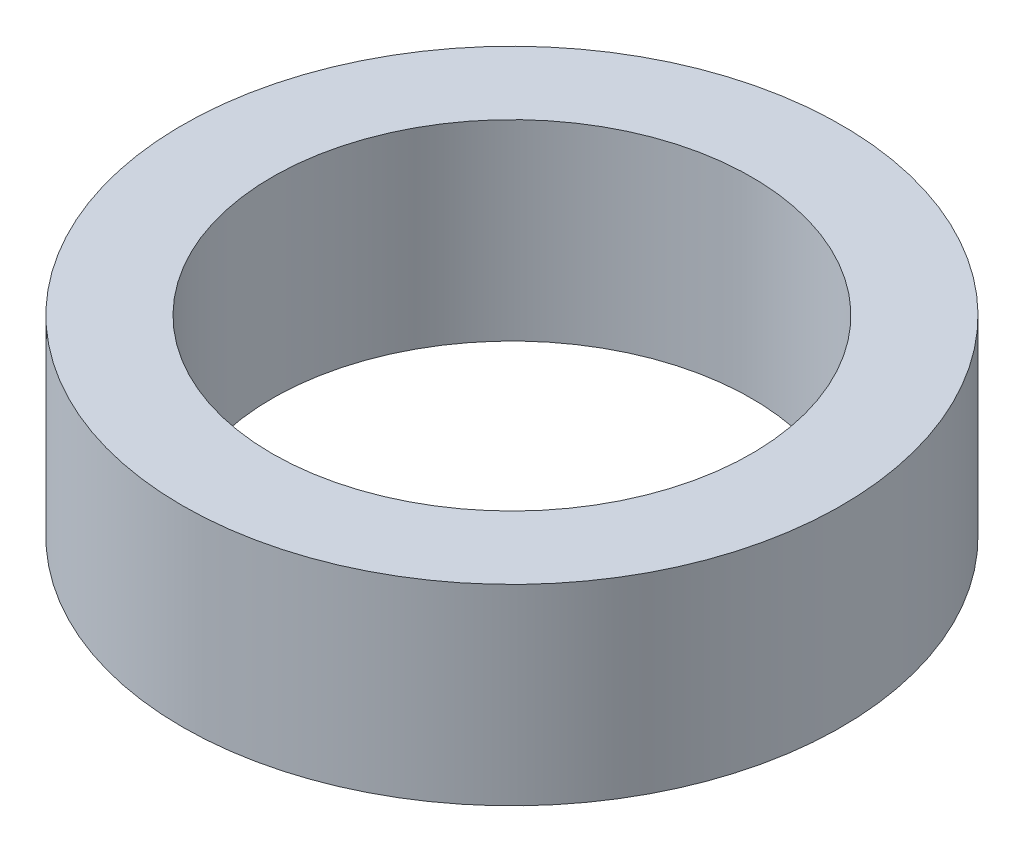
ISO-10303-21;
HEADER;
FILE_DESCRIPTION(('STEP AP214'),'2;1');
FILE_NAME('part.step','',(''),(''),'','','');
FILE_SCHEMA(('AUTOMOTIVE_DESIGN { 1 0 10303 214 1 1 1 1 }'));
ENDSEC;
DATA;
#1=APPLICATION_CONTEXT('core data for automotive mechanical design processes');
#2=APPLICATION_PROTOCOL_DEFINITION('international standard','automotive_design',2000,#1);
#3=PRODUCT_CONTEXT('',#1,'mechanical');
#4=PRODUCT('Part','Part','',(#3));
#5=PRODUCT_RELATED_PRODUCT_CATEGORY('part','',(#4));
#6=PRODUCT_DEFINITION_FORMATION('','',#4);
#7=PRODUCT_DEFINITION_CONTEXT('part definition',#1,'design');
#8=PRODUCT_DEFINITION('design','',#6,#7);
#9=PRODUCT_DEFINITION_SHAPE('','',#8);
#10=(LENGTH_UNIT() NAMED_UNIT(*) SI_UNIT(.MILLI.,.METRE.));
#11=(NAMED_UNIT(*) PLANE_ANGLE_UNIT() SI_UNIT($,.RADIAN.));
#12=(NAMED_UNIT(*) SI_UNIT($,.STERADIAN.) SOLID_ANGLE_UNIT());
#13=UNCERTAINTY_MEASURE_WITH_UNIT(LENGTH_MEASURE(1.E-05),#10,'distance_accuracy_value','');
#14=(GEOMETRIC_REPRESENTATION_CONTEXT(3) GLOBAL_UNCERTAINTY_ASSIGNED_CONTEXT((#13)) GLOBAL_UNIT_ASSIGNED_CONTEXT((#10,
#11,#12)) REPRESENTATION_CONTEXT('',''));
#15=CARTESIAN_POINT('',(0.,0.,0.));
#16=DIRECTION('',(0.,0.,1.));
#17=DIRECTION('',(1.,0.,0.));
#18=AXIS2_PLACEMENT_3D('',#15,#16,#17);
#19=CARTESIAN_POINT('',(0.,16.,0.));
#20=DIRECTION('',(0.,-1.,0.));
#21=DIRECTION('',(0.,0.,-1.));
#22=AXIS2_PLACEMENT_3D('',#19,#20,#21);
#23=CYLINDRICAL_SURFACE('',#22,27.5);
#24=CARTESIAN_POINT('',(0.,16.,0.));
#25=DIRECTION('',(0.,1.,0.));
#26=DIRECTION('',(0.,0.,1.));
#27=AXIS2_PLACEMENT_3D('',#24,#25,#26);
#28=CIRCLE('',#27,27.5);
#29=CARTESIAN_POINT('',(0.,16.,27.5));
#30=VERTEX_POINT('',#29);
#31=EDGE_CURVE('E10',#30,#30,#28,.T.);
#32=ORIENTED_EDGE('',*,*,#31,.F.);
#33=EDGE_LOOP('',(#32));
#34=FACE_BOUND('',#33,.T.);
#35=CARTESIAN_POINT('',(0.,0.,0.));
#36=DIRECTION('',(0.,1.,0.));
#37=DIRECTION('',(0.,0.,1.));
#38=AXIS2_PLACEMENT_3D('',#35,#36,#37);
#39=CIRCLE('',#38,27.5);
#40=CARTESIAN_POINT('',(0.,0.,27.5));
#41=VERTEX_POINT('',#40);
#42=EDGE_CURVE('E37',#41,#41,#39,.T.);
#43=ORIENTED_EDGE('',*,*,#42,.T.);
#44=EDGE_LOOP('',(#43));
#45=FACE_BOUND('',#44,.T.);
#46=ADVANCED_FACE('F40',(#34,#45),#23,.T.);
#47=CARTESIAN_POINT('',(0.,16.,0.));
#48=DIRECTION('',(0.,1.,0.));
#49=DIRECTION('',(0.,0.,1.));
#50=AXIS2_PLACEMENT_3D('',#47,#48,#49);
#51=PLANE('',#50);
#52=CARTESIAN_POINT('',(0.,16.,0.));
#53=DIRECTION('',(0.,1.,0.));
#54=DIRECTION('',(0.,0.,1.));
#55=AXIS2_PLACEMENT_3D('',#52,#53,#54);
#56=CIRCLE('',#55,20.);
#57=CARTESIAN_POINT('',(0.,16.,20.));
#58=VERTEX_POINT('',#57);
#59=EDGE_CURVE('E50',#58,#58,#56,.T.);
#60=ORIENTED_EDGE('',*,*,#59,.F.);
#61=EDGE_LOOP('',(#60));
#62=FACE_BOUND('',#61,.T.);
#63=ORIENTED_EDGE('',*,*,#31,.T.);
#64=EDGE_LOOP('',(#63));
#65=FACE_BOUND('',#64,.T.);
#66=ADVANCED_FACE('F59',(#62,#65),#51,.T.);
#67=CARTESIAN_POINT('',(0.,0.,0.));
#68=DIRECTION('',(0.,1.,0.));
#69=DIRECTION('',(0.,0.,1.));
#70=AXIS2_PLACEMENT_3D('',#67,#68,#69);
#71=PLANE('',#70);
#72=CARTESIAN_POINT('',(0.,0.,0.));
#73=DIRECTION('',(0.,1.,0.));
#74=DIRECTION('',(0.,0.,1.));
#75=AXIS2_PLACEMENT_3D('',#72,#73,#74);
#76=CIRCLE('',#75,20.);
#77=CARTESIAN_POINT('',(0.,0.,20.));
#78=VERTEX_POINT('',#77);
#79=EDGE_CURVE('E47',#78,#78,#76,.T.);
#80=ORIENTED_EDGE('',*,*,#79,.T.);
#81=EDGE_LOOP('',(#80));
#82=FACE_BOUND('',#81,.T.);
#83=ORIENTED_EDGE('',*,*,#42,.F.);
#84=EDGE_LOOP('',(#83));
#85=FACE_BOUND('',#84,.T.);
#86=ADVANCED_FACE('F58',(#82,#85),#71,.F.);
#87=CARTESIAN_POINT('',(0.,16.,0.));
#88=DIRECTION('',(0.,-1.,0.));
#89=DIRECTION('',(0.,0.,-1.));
#90=AXIS2_PLACEMENT_3D('',#87,#88,#89);
#91=CYLINDRICAL_SURFACE('',#90,20.);
#92=ORIENTED_EDGE('',*,*,#59,.T.);
#93=EDGE_LOOP('',(#92));
#94=FACE_BOUND('',#93,.T.);
#95=ORIENTED_EDGE('',*,*,#79,.F.);
#96=EDGE_LOOP('',(#95));
#97=FACE_BOUND('',#96,.T.);
#98=ADVANCED_FACE('F54',(#94,#97),#91,.F.);
#99=CLOSED_SHELL('',(#46,#66,#86,#98));
#100=MANIFOLD_SOLID_BREP('B2',#99);
#101=ADVANCED_BREP_SHAPE_REPRESENTATION('',(#18,#100),#14);
#102=SHAPE_DEFINITION_REPRESENTATION(#9,#101);
ENDSEC;
END-ISO-10303-21;
